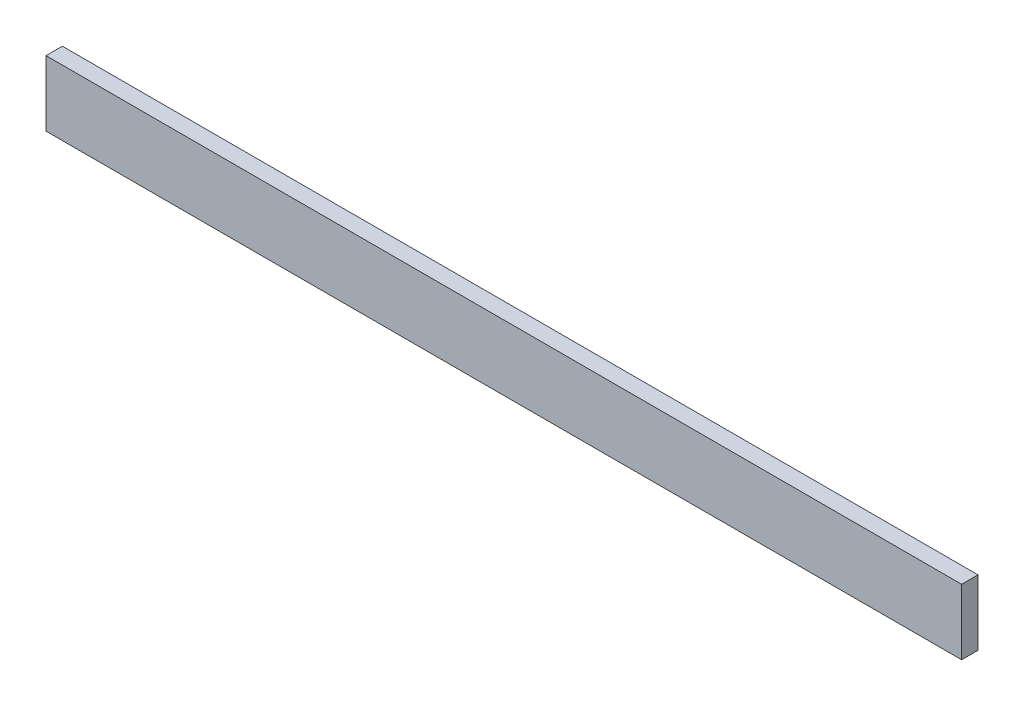
ISO-10303-21;
HEADER;
FILE_DESCRIPTION(('STEP AP214'),'2;1');
FILE_NAME('part.step','',(''),(''),'','','');
FILE_SCHEMA(('AUTOMOTIVE_DESIGN { 1 0 10303 214 1 1 1 1 }'));
ENDSEC;
DATA;
#1=APPLICATION_CONTEXT('core data for automotive mechanical design processes');
#2=APPLICATION_PROTOCOL_DEFINITION('international standard','automotive_design',2000,#1);
#3=PRODUCT_CONTEXT('',#1,'mechanical');
#4=PRODUCT('Part','Part','',(#3));
#5=PRODUCT_RELATED_PRODUCT_CATEGORY('part','',(#4));
#6=PRODUCT_DEFINITION_FORMATION('','',#4);
#7=PRODUCT_DEFINITION_CONTEXT('part definition',#1,'design');
#8=PRODUCT_DEFINITION('design','',#6,#7);
#9=PRODUCT_DEFINITION_SHAPE('','',#8);
#10=(LENGTH_UNIT() NAMED_UNIT(*) SI_UNIT(.MILLI.,.METRE.));
#11=(NAMED_UNIT(*) PLANE_ANGLE_UNIT() SI_UNIT($,.RADIAN.));
#12=(NAMED_UNIT(*) SI_UNIT($,.STERADIAN.) SOLID_ANGLE_UNIT());
#13=UNCERTAINTY_MEASURE_WITH_UNIT(LENGTH_MEASURE(1.E-05),#10,'distance_accuracy_value','');
#14=(GEOMETRIC_REPRESENTATION_CONTEXT(3) GLOBAL_UNCERTAINTY_ASSIGNED_CONTEXT((#13)) GLOBAL_UNIT_ASSIGNED_CONTEXT((#10,
#11,#12)) REPRESENTATION_CONTEXT('',''));
#15=CARTESIAN_POINT('',(0.,0.,0.));
#16=DIRECTION('',(0.,0.,1.));
#17=DIRECTION('',(1.,0.,0.));
#18=AXIS2_PLACEMENT_3D('',#15,#16,#17);
#19=CARTESIAN_POINT('',(88.9,-6.34999999999999,3.175));
#20=DIRECTION('',(-1.,0.,0.));
#21=DIRECTION('',(0.,0.,1.));
#22=AXIS2_PLACEMENT_3D('',#19,#20,#21);
#23=PLANE('',#22);
#24=DIRECTION('',(0.,1.,0.));
#25=VECTOR('',#24,1.);
#26=CARTESIAN_POINT('',(88.9,-6.34999999999999,0.));
#27=LINE('',#26,#25);
#28=CARTESIAN_POINT('',(88.9,-6.34999999999999,0.));
#29=VERTEX_POINT('',#28);
#30=CARTESIAN_POINT('',(88.9,6.35,0.));
#31=VERTEX_POINT('',#30);
#32=EDGE_CURVE('E107',#29,#31,#27,.T.);
#33=ORIENTED_EDGE('',*,*,#32,.T.);
#34=DIRECTION('',(0.,0.,-1.));
#35=VECTOR('',#34,1.);
#36=CARTESIAN_POINT('',(88.9,6.35,3.175));
#37=LINE('',#36,#35);
#38=CARTESIAN_POINT('',(88.9,6.35,3.175));
#39=VERTEX_POINT('',#38);
#40=EDGE_CURVE('E11',#39,#31,#37,.T.);
#41=ORIENTED_EDGE('',*,*,#40,.F.);
#42=DIRECTION('',(0.,1.,0.));
#43=VECTOR('',#42,1.);
#44=CARTESIAN_POINT('',(88.9,-6.34999999999999,3.175));
#45=LINE('',#44,#43);
#46=CARTESIAN_POINT('',(88.9,-6.34999999999999,3.175));
#47=VERTEX_POINT('',#46);
#48=EDGE_CURVE('E91',#47,#39,#45,.T.);
#49=ORIENTED_EDGE('',*,*,#48,.F.);
#50=DIRECTION('',(0.,0.,-1.));
#51=VECTOR('',#50,1.);
#52=CARTESIAN_POINT('',(88.9,-6.34999999999999,3.175));
#53=LINE('',#52,#51);
#54=EDGE_CURVE('E103',#47,#29,#53,.T.);
#55=ORIENTED_EDGE('',*,*,#54,.T.);
#56=EDGE_LOOP('',(#33,#41,#49,#55));
#57=FACE_BOUND('',#56,.T.);
#58=ADVANCED_FACE('F39',(#57),#23,.F.);
#59=CARTESIAN_POINT('',(-88.9,6.35,3.175));
#60=DIRECTION('',(0.,-1.,0.));
#61=DIRECTION('',(0.,0.,-1.));
#62=AXIS2_PLACEMENT_3D('',#59,#60,#61);
#63=PLANE('',#62);
#64=DIRECTION('',(-1.,0.,0.));
#65=VECTOR('',#64,1.);
#66=CARTESIAN_POINT('',(-88.9,6.35,0.));
#67=LINE('',#66,#65);
#68=CARTESIAN_POINT('',(-88.9,6.35,0.));
#69=VERTEX_POINT('',#68);
#70=EDGE_CURVE('E96',#31,#69,#67,.T.);
#71=ORIENTED_EDGE('',*,*,#70,.T.);
#72=DIRECTION('',(0.,0.,-1.));
#73=VECTOR('',#72,1.);
#74=CARTESIAN_POINT('',(-88.9,6.35,3.175));
#75=LINE('',#74,#73);
#76=CARTESIAN_POINT('',(-88.9,6.35,3.175));
#77=VERTEX_POINT('',#76);
#78=EDGE_CURVE('E48',#77,#69,#75,.T.);
#79=ORIENTED_EDGE('',*,*,#78,.F.);
#80=DIRECTION('',(-1.,0.,0.));
#81=VECTOR('',#80,1.);
#82=CARTESIAN_POINT('',(-88.9,6.35,3.175));
#83=LINE('',#82,#81);
#84=EDGE_CURVE('E86',#39,#77,#83,.T.);
#85=ORIENTED_EDGE('',*,*,#84,.F.);
#86=ORIENTED_EDGE('',*,*,#40,.T.);
#87=EDGE_LOOP('',(#71,#79,#85,#86));
#88=FACE_BOUND('',#87,.T.);
#89=ADVANCED_FACE('F95',(#88),#63,.F.);
#90=CARTESIAN_POINT('',(-88.9,-6.34999999999999,3.175));
#91=DIRECTION('',(1.,0.,0.));
#92=DIRECTION('',(0.,0.,-1.));
#93=AXIS2_PLACEMENT_3D('',#90,#91,#92);
#94=PLANE('',#93);
#95=DIRECTION('',(0.,-1.,0.));
#96=VECTOR('',#95,1.);
#97=CARTESIAN_POINT('',(-88.9,-6.34999999999999,0.));
#98=LINE('',#97,#96);
#99=CARTESIAN_POINT('',(-88.9,-6.34999999999999,0.));
#100=VERTEX_POINT('',#99);
#101=EDGE_CURVE('E73',#69,#100,#98,.T.);
#102=ORIENTED_EDGE('',*,*,#101,.T.);
#103=DIRECTION('',(0.,0.,-1.));
#104=VECTOR('',#103,1.);
#105=CARTESIAN_POINT('',(-88.9,-6.34999999999999,3.175));
#106=LINE('',#105,#104);
#107=CARTESIAN_POINT('',(-88.9,-6.34999999999999,3.175));
#108=VERTEX_POINT('',#107);
#109=EDGE_CURVE('E98',#108,#100,#106,.T.);
#110=ORIENTED_EDGE('',*,*,#109,.F.);
#111=DIRECTION('',(0.,-1.,0.));
#112=VECTOR('',#111,1.);
#113=CARTESIAN_POINT('',(-88.9,-6.34999999999999,3.175));
#114=LINE('',#113,#112);
#115=EDGE_CURVE('E89',#77,#108,#114,.T.);
#116=ORIENTED_EDGE('',*,*,#115,.F.);
#117=ORIENTED_EDGE('',*,*,#78,.T.);
#118=EDGE_LOOP('',(#102,#110,#116,#117));
#119=FACE_BOUND('',#118,.T.);
#120=ADVANCED_FACE('F99',(#119),#94,.F.);
#121=CARTESIAN_POINT('',(-88.9,-6.34999999999999,3.175));
#122=DIRECTION('',(0.,1.,0.));
#123=DIRECTION('',(0.,0.,1.));
#124=AXIS2_PLACEMENT_3D('',#121,#122,#123);
#125=PLANE('',#124);
#126=DIRECTION('',(1.,0.,0.));
#127=VECTOR('',#126,1.);
#128=CARTESIAN_POINT('',(-88.9,-6.34999999999999,0.));
#129=LINE('',#128,#127);
#130=EDGE_CURVE('E79',#100,#29,#129,.T.);
#131=ORIENTED_EDGE('',*,*,#130,.T.);
#132=ORIENTED_EDGE('',*,*,#54,.F.);
#133=DIRECTION('',(1.,0.,0.));
#134=VECTOR('',#133,1.);
#135=CARTESIAN_POINT('',(-88.9,-6.34999999999999,3.175));
#136=LINE('',#135,#134);
#137=EDGE_CURVE('E56',#108,#47,#136,.T.);
#138=ORIENTED_EDGE('',*,*,#137,.F.);
#139=ORIENTED_EDGE('',*,*,#109,.T.);
#140=EDGE_LOOP('',(#131,#132,#138,#139));
#141=FACE_BOUND('',#140,.T.);
#142=ADVANCED_FACE('F120',(#141),#125,.F.);
#143=CARTESIAN_POINT('',(0.,0.,3.175));
#144=DIRECTION('',(0.,0.,-1.));
#145=DIRECTION('',(-1.,0.,0.));
#146=AXIS2_PLACEMENT_3D('',#143,#144,#145);
#147=PLANE('',#146);
#148=ORIENTED_EDGE('',*,*,#48,.T.);
#149=ORIENTED_EDGE('',*,*,#84,.T.);
#150=ORIENTED_EDGE('',*,*,#115,.T.);
#151=ORIENTED_EDGE('',*,*,#137,.T.);
#152=EDGE_LOOP('',(#148,#149,#150,#151));
#153=FACE_BOUND('',#152,.T.);
#154=ADVANCED_FACE('F87',(#153),#147,.F.);
#155=CARTESIAN_POINT('',(0.,0.,0.));
#156=DIRECTION('',(0.,0.,-1.));
#157=DIRECTION('',(-1.,0.,0.));
#158=AXIS2_PLACEMENT_3D('',#155,#156,#157);
#159=PLANE('',#158);
#160=ORIENTED_EDGE('',*,*,#32,.F.);
#161=ORIENTED_EDGE('',*,*,#130,.F.);
#162=ORIENTED_EDGE('',*,*,#101,.F.);
#163=ORIENTED_EDGE('',*,*,#70,.F.);
#164=EDGE_LOOP('',(#160,#161,#162,#163));
#165=FACE_BOUND('',#164,.T.);
#166=ADVANCED_FACE('F123',(#165),#159,.T.);
#167=CLOSED_SHELL('',(#58,#89,#120,#142,#154,#166));
#168=MANIFOLD_SOLID_BREP('B2',#167);
#169=ADVANCED_BREP_SHAPE_REPRESENTATION('',(#18,#168),#14);
#170=SHAPE_DEFINITION_REPRESENTATION(#9,#169);
ENDSEC;
END-ISO-10303-21;
